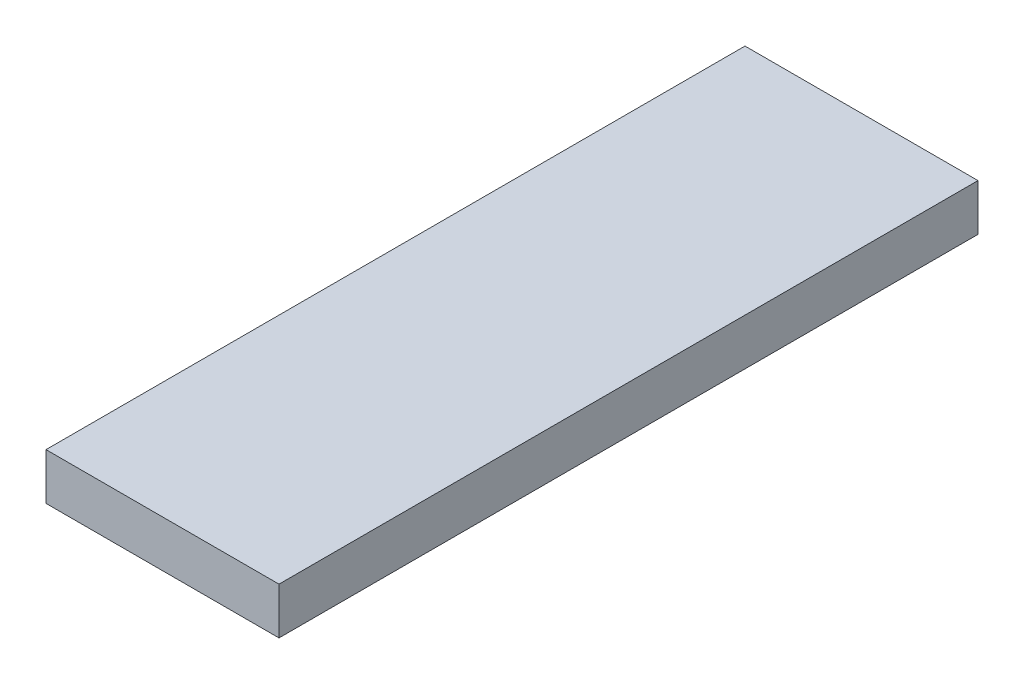
ISO-10303-21;
HEADER;
FILE_DESCRIPTION(('STEP AP214'),'2;1');
FILE_NAME('part.step','',(''),(''),'','','');
FILE_SCHEMA(('AUTOMOTIVE_DESIGN { 1 0 10303 214 1 1 1 1 }'));
ENDSEC;
DATA;
#1=APPLICATION_CONTEXT('core data for automotive mechanical design processes');
#2=APPLICATION_PROTOCOL_DEFINITION('international standard','automotive_design',2000,#1);
#3=PRODUCT_CONTEXT('',#1,'mechanical');
#4=PRODUCT('Part','Part','',(#3));
#5=PRODUCT_RELATED_PRODUCT_CATEGORY('part','',(#4));
#6=PRODUCT_DEFINITION_FORMATION('','',#4);
#7=PRODUCT_DEFINITION_CONTEXT('part definition',#1,'design');
#8=PRODUCT_DEFINITION('design','',#6,#7);
#9=PRODUCT_DEFINITION_SHAPE('','',#8);
#10=(LENGTH_UNIT() NAMED_UNIT(*) SI_UNIT(.MILLI.,.METRE.));
#11=(NAMED_UNIT(*) PLANE_ANGLE_UNIT() SI_UNIT($,.RADIAN.));
#12=(NAMED_UNIT(*) SI_UNIT($,.STERADIAN.) SOLID_ANGLE_UNIT());
#13=UNCERTAINTY_MEASURE_WITH_UNIT(LENGTH_MEASURE(1.E-05),#10,'distance_accuracy_value','');
#14=(GEOMETRIC_REPRESENTATION_CONTEXT(3) GLOBAL_UNCERTAINTY_ASSIGNED_CONTEXT((#13)) GLOBAL_UNIT_ASSIGNED_CONTEXT((#10,
#11,#12)) REPRESENTATION_CONTEXT('',''));
#15=CARTESIAN_POINT('',(0.,0.,0.));
#16=DIRECTION('',(0.,0.,1.));
#17=DIRECTION('',(1.,0.,0.));
#18=AXIS2_PLACEMENT_3D('',#15,#16,#17);
#19=CARTESIAN_POINT('',(-17.8483530678148,2.,11.2840186580553));
#20=DIRECTION('',(1.,0.,0.));
#21=DIRECTION('',(0.,0.,-1.));
#22=AXIS2_PLACEMENT_3D('',#19,#20,#21);
#23=PLANE('',#22);
#24=DIRECTION('',(0.,0.,1.));
#25=VECTOR('',#24,1.);
#26=CARTESIAN_POINT('',(-17.8483530678148,0.,11.2840186580553));
#27=LINE('',#26,#25);
#28=CARTESIAN_POINT('',(-17.8483530678148,0.,-18.7159813419447));
#29=VERTEX_POINT('',#28);
#30=CARTESIAN_POINT('',(-17.8483530678148,0.,11.2840186580553));
#31=VERTEX_POINT('',#30);
#32=EDGE_CURVE('E98',#29,#31,#27,.T.);
#33=ORIENTED_EDGE('',*,*,#32,.T.);
#34=DIRECTION('',(0.,-1.,0.));
#35=VECTOR('',#34,1.);
#36=CARTESIAN_POINT('',(-17.8483530678148,2.,11.2840186580553));
#37=LINE('',#36,#35);
#38=CARTESIAN_POINT('',(-17.8483530678148,2.,11.2840186580553));
#39=VERTEX_POINT('',#38);
#40=EDGE_CURVE('E11',#39,#31,#37,.T.);
#41=ORIENTED_EDGE('',*,*,#40,.F.);
#42=DIRECTION('',(0.,0.,1.));
#43=VECTOR('',#42,1.);
#44=CARTESIAN_POINT('',(-17.8483530678148,2.,11.2840186580553));
#45=LINE('',#44,#43);
#46=CARTESIAN_POINT('',(-17.8483530678148,2.,-18.7159813419447));
#47=VERTEX_POINT('',#46);
#48=EDGE_CURVE('E86',#47,#39,#45,.T.);
#49=ORIENTED_EDGE('',*,*,#48,.F.);
#50=DIRECTION('',(0.,-1.,0.));
#51=VECTOR('',#50,1.);
#52=CARTESIAN_POINT('',(-17.8483530678148,2.,-18.7159813419447));
#53=LINE('',#52,#51);
#54=EDGE_CURVE('E94',#47,#29,#53,.T.);
#55=ORIENTED_EDGE('',*,*,#54,.T.);
#56=EDGE_LOOP('',(#33,#41,#49,#55));
#57=FACE_BOUND('',#56,.T.);
#58=ADVANCED_FACE('F35',(#57),#23,.F.);
#59=CARTESIAN_POINT('',(-7.84835306781485,2.,11.2840186580553));
#60=DIRECTION('',(0.,0.,-1.));
#61=DIRECTION('',(-1.,0.,0.));
#62=AXIS2_PLACEMENT_3D('',#59,#60,#61);
#63=PLANE('',#62);
#64=DIRECTION('',(1.,0.,0.));
#65=VECTOR('',#64,1.);
#66=CARTESIAN_POINT('',(-7.84835306781485,0.,11.2840186580553));
#67=LINE('',#66,#65);
#68=CARTESIAN_POINT('',(-7.84835306781485,0.,11.2840186580553));
#69=VERTEX_POINT('',#68);
#70=EDGE_CURVE('E90',#31,#69,#67,.T.);
#71=ORIENTED_EDGE('',*,*,#70,.T.);
#72=DIRECTION('',(0.,-1.,0.));
#73=VECTOR('',#72,1.);
#74=CARTESIAN_POINT('',(-7.84835306781485,2.,11.2840186580553));
#75=LINE('',#74,#73);
#76=CARTESIAN_POINT('',(-7.84835306781485,2.,11.2840186580553));
#77=VERTEX_POINT('',#76);
#78=EDGE_CURVE('E43',#77,#69,#75,.T.);
#79=ORIENTED_EDGE('',*,*,#78,.F.);
#80=DIRECTION('',(1.,0.,0.));
#81=VECTOR('',#80,1.);
#82=CARTESIAN_POINT('',(-7.84835306781485,2.,11.2840186580553));
#83=LINE('',#82,#81);
#84=EDGE_CURVE('E81',#39,#77,#83,.T.);
#85=ORIENTED_EDGE('',*,*,#84,.F.);
#86=ORIENTED_EDGE('',*,*,#40,.T.);
#87=EDGE_LOOP('',(#71,#79,#85,#86));
#88=FACE_BOUND('',#87,.T.);
#89=ADVANCED_FACE('F89',(#88),#63,.F.);
#90=CARTESIAN_POINT('',(-7.84835306781485,2.,-18.7159813419447));
#91=DIRECTION('',(-1.,0.,0.));
#92=DIRECTION('',(0.,0.,1.));
#93=AXIS2_PLACEMENT_3D('',#90,#91,#92);
#94=PLANE('',#93);
#95=DIRECTION('',(0.,0.,-1.));
#96=VECTOR('',#95,1.);
#97=CARTESIAN_POINT('',(-7.84835306781485,0.,-18.7159813419447));
#98=LINE('',#97,#96);
#99=CARTESIAN_POINT('',(-7.84835306781485,0.,-18.7159813419447));
#100=VERTEX_POINT('',#99);
#101=EDGE_CURVE('E68',#69,#100,#98,.T.);
#102=ORIENTED_EDGE('',*,*,#101,.T.);
#103=DIRECTION('',(0.,-1.,0.));
#104=VECTOR('',#103,1.);
#105=CARTESIAN_POINT('',(-7.84835306781485,2.,-18.7159813419447));
#106=LINE('',#105,#104);
#107=CARTESIAN_POINT('',(-7.84835306781485,2.,-18.7159813419447));
#108=VERTEX_POINT('',#107);
#109=EDGE_CURVE('E91',#108,#100,#106,.T.);
#110=ORIENTED_EDGE('',*,*,#109,.F.);
#111=DIRECTION('',(0.,0.,-1.));
#112=VECTOR('',#111,1.);
#113=CARTESIAN_POINT('',(-7.84835306781485,2.,-18.7159813419447));
#114=LINE('',#113,#112);
#115=EDGE_CURVE('E84',#77,#108,#114,.T.);
#116=ORIENTED_EDGE('',*,*,#115,.F.);
#117=ORIENTED_EDGE('',*,*,#78,.T.);
#118=EDGE_LOOP('',(#102,#110,#116,#117));
#119=FACE_BOUND('',#118,.T.);
#120=ADVANCED_FACE('F92',(#119),#94,.F.);
#121=CARTESIAN_POINT('',(-17.8483530678148,2.,-18.7159813419447));
#122=DIRECTION('',(0.,0.,1.));
#123=DIRECTION('',(1.,0.,0.));
#124=AXIS2_PLACEMENT_3D('',#121,#122,#123);
#125=PLANE('',#124);
#126=DIRECTION('',(-1.,0.,0.));
#127=VECTOR('',#126,1.);
#128=CARTESIAN_POINT('',(-17.8483530678148,0.,-18.7159813419447));
#129=LINE('',#128,#127);
#130=EDGE_CURVE('E74',#100,#29,#129,.T.);
#131=ORIENTED_EDGE('',*,*,#130,.T.);
#132=ORIENTED_EDGE('',*,*,#54,.F.);
#133=DIRECTION('',(-1.,0.,0.));
#134=VECTOR('',#133,1.);
#135=CARTESIAN_POINT('',(-17.8483530678148,2.,-18.7159813419447));
#136=LINE('',#135,#134);
#137=EDGE_CURVE('E51',#108,#47,#136,.T.);
#138=ORIENTED_EDGE('',*,*,#137,.F.);
#139=ORIENTED_EDGE('',*,*,#109,.T.);
#140=EDGE_LOOP('',(#131,#132,#138,#139));
#141=FACE_BOUND('',#140,.T.);
#142=ADVANCED_FACE('F105',(#141),#125,.F.);
#143=CARTESIAN_POINT('',(0.,2.,0.));
#144=DIRECTION('',(0.,-1.,0.));
#145=DIRECTION('',(0.,0.,-1.));
#146=AXIS2_PLACEMENT_3D('',#143,#144,#145);
#147=PLANE('',#146);
#148=ORIENTED_EDGE('',*,*,#48,.T.);
#149=ORIENTED_EDGE('',*,*,#84,.T.);
#150=ORIENTED_EDGE('',*,*,#115,.T.);
#151=ORIENTED_EDGE('',*,*,#137,.T.);
#152=EDGE_LOOP('',(#148,#149,#150,#151));
#153=FACE_BOUND('',#152,.T.);
#154=ADVANCED_FACE('F82',(#153),#147,.F.);
#155=CARTESIAN_POINT('',(0.,0.,0.));
#156=DIRECTION('',(0.,-1.,0.));
#157=DIRECTION('',(0.,0.,-1.));
#158=AXIS2_PLACEMENT_3D('',#155,#156,#157);
#159=PLANE('',#158);
#160=ORIENTED_EDGE('',*,*,#32,.F.);
#161=ORIENTED_EDGE('',*,*,#130,.F.);
#162=ORIENTED_EDGE('',*,*,#101,.F.);
#163=ORIENTED_EDGE('',*,*,#70,.F.);
#164=EDGE_LOOP('',(#160,#161,#162,#163));
#165=FACE_BOUND('',#164,.T.);
#166=ADVANCED_FACE('F108',(#165),#159,.T.);
#167=CLOSED_SHELL('',(#58,#89,#120,#142,#154,#166));
#168=MANIFOLD_SOLID_BREP('B2',#167);
#169=ADVANCED_BREP_SHAPE_REPRESENTATION('',(#18,#168),#14);
#170=SHAPE_DEFINITION_REPRESENTATION(#9,#169);
ENDSEC;
END-ISO-10303-21;
